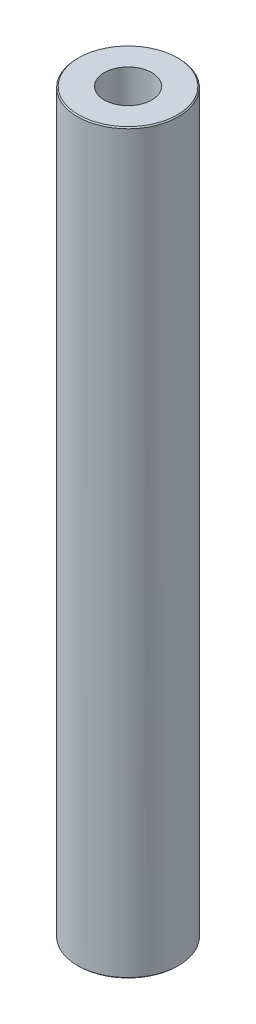
ISO-10303-21;
HEADER;
FILE_DESCRIPTION(('STEP AP214'),'2;1');
FILE_NAME('part.step','',(''),(''),'','','');
FILE_SCHEMA(('AUTOMOTIVE_DESIGN { 1 0 10303 214 1 1 1 1 }'));
ENDSEC;
DATA;
#1=APPLICATION_CONTEXT('core data for automotive mechanical design processes');
#2=APPLICATION_PROTOCOL_DEFINITION('international standard','automotive_design',2000,#1);
#3=PRODUCT_CONTEXT('',#1,'mechanical');
#4=PRODUCT('Part','Part','',(#3));
#5=PRODUCT_RELATED_PRODUCT_CATEGORY('part','',(#4));
#6=PRODUCT_DEFINITION_FORMATION('','',#4);
#7=PRODUCT_DEFINITION_CONTEXT('part definition',#1,'design');
#8=PRODUCT_DEFINITION('design','',#6,#7);
#9=PRODUCT_DEFINITION_SHAPE('','',#8);
#10=(LENGTH_UNIT() NAMED_UNIT(*) SI_UNIT(.MILLI.,.METRE.));
#11=(NAMED_UNIT(*) PLANE_ANGLE_UNIT() SI_UNIT($,.RADIAN.));
#12=(NAMED_UNIT(*) SI_UNIT($,.STERADIAN.) SOLID_ANGLE_UNIT());
#13=UNCERTAINTY_MEASURE_WITH_UNIT(LENGTH_MEASURE(1.E-05),#10,'distance_accuracy_value','');
#14=(GEOMETRIC_REPRESENTATION_CONTEXT(3) GLOBAL_UNCERTAINTY_ASSIGNED_CONTEXT((#13)) GLOBAL_UNIT_ASSIGNED_CONTEXT((#10,
#11,#12)) REPRESENTATION_CONTEXT('',''));
#15=CARTESIAN_POINT('',(0.,0.,0.));
#16=DIRECTION('',(0.,0.,1.));
#17=DIRECTION('',(1.,0.,0.));
#18=AXIS2_PLACEMENT_3D('',#15,#16,#17);
#19=CARTESIAN_POINT('',(0.,583.947641491248,0.));
#20=DIRECTION('',(0.,-1.,0.));
#21=DIRECTION('',(0.,0.,-1.));
#22=AXIS2_PLACEMENT_3D('',#19,#20,#21);
#23=CYLINDRICAL_SURFACE('',#22,40.);
#24=CARTESIAN_POINT('',(0.,583.075890248208,0.));
#25=DIRECTION('',(0.,1.,0.));
#26=DIRECTION('',(0.,0.,1.));
#27=AXIS2_PLACEMENT_3D('',#24,#25,#26);
#28=CIRCLE('',#27,40.);
#29=CARTESIAN_POINT('',(0.,583.075890248208,-40.));
#30=VERTEX_POINT('',#29);
#31=EDGE_CURVE('E50',#30,#30,#28,.F.);
#32=CARTESIAN_POINT('',(0.,0.871751243039287,0.));
#33=DIRECTION('',(0.,1.,0.));
#34=DIRECTION('',(0.,0.,1.));
#35=AXIS2_PLACEMENT_3D('',#32,#33,#34);
#36=CIRCLE('',#35,40.);
#37=CARTESIAN_POINT('',(0.,0.871751243039287,-40.));
#38=VERTEX_POINT('',#37);
#39=EDGE_CURVE('E51',#38,#38,#36,.T.);
#40=CARTESIAN_POINT('',(0.,583.075890248208,-40.));
#41=CARTESIAN_POINT('',(0.,577.011263800237,-40.));
#42=CARTESIAN_POINT('',(0.,570.946637352267,-40.));
#43=CARTESIAN_POINT('',(0.,558.817384456326,-40.));
#44=CARTESIAN_POINT('',(0.,552.752758008355,-40.));
#45=CARTESIAN_POINT('',(0.,540.623505112414,-40.));
#46=CARTESIAN_POINT('',(0.,534.558878664444,-40.));
#47=CARTESIAN_POINT('',(0.,522.429625768503,-40.));
#48=CARTESIAN_POINT('',(0.,516.364999320532,-40.));
#49=CARTESIAN_POINT('',(0.,504.235746424591,-40.));
#50=CARTESIAN_POINT('',(0.,498.171119976621,-40.));
#51=CARTESIAN_POINT('',(0.,486.04186708068,-40.));
#52=CARTESIAN_POINT('',(0.,479.977240632709,-40.));
#53=CARTESIAN_POINT('',(0.,467.847987736768,-40.));
#54=CARTESIAN_POINT('',(0.,461.783361288798,-40.));
#55=CARTESIAN_POINT('',(0.,449.654108392857,-40.));
#56=CARTESIAN_POINT('',(0.,443.589481944886,-40.));
#57=CARTESIAN_POINT('',(0.,431.460229048945,-40.));
#58=CARTESIAN_POINT('',(0.,425.395602600975,-40.));
#59=CARTESIAN_POINT('',(0.,413.266349705034,-40.));
#60=CARTESIAN_POINT('',(0.,407.201723257063,-40.));
#61=CARTESIAN_POINT('',(0.,395.072470361122,-40.));
#62=CARTESIAN_POINT('',(0.,389.007843913152,-40.));
#63=CARTESIAN_POINT('',(0.,376.878591017211,-40.));
#64=CARTESIAN_POINT('',(0.,370.81396456924,-40.));
#65=CARTESIAN_POINT('',(0.,358.684711673299,-40.));
#66=CARTESIAN_POINT('',(0.,352.620085225329,-40.));
#67=CARTESIAN_POINT('',(0.,340.490832329388,-40.));
#68=CARTESIAN_POINT('',(0.,334.426205881417,-40.));
#69=CARTESIAN_POINT('',(0.,322.296952985476,-40.));
#70=CARTESIAN_POINT('',(0.,316.232326537506,-40.));
#71=CARTESIAN_POINT('',(0.,304.103073641565,-40.));
#72=CARTESIAN_POINT('',(0.,298.038447193594,-40.));
#73=CARTESIAN_POINT('',(0.,285.909194297653,-40.));
#74=CARTESIAN_POINT('',(0.,279.844567849683,-40.));
#75=CARTESIAN_POINT('',(0.,267.715314953742,-40.));
#76=CARTESIAN_POINT('',(0.,261.650688505771,-40.));
#77=CARTESIAN_POINT('',(0.,249.52143560983,-40.));
#78=CARTESIAN_POINT('',(0.,243.45680916186,-40.));
#79=CARTESIAN_POINT('',(0.,231.327556265919,-40.));
#80=CARTESIAN_POINT('',(0.,225.262929817948,-40.));
#81=CARTESIAN_POINT('',(0.,213.133676922007,-40.));
#82=CARTESIAN_POINT('',(0.,207.069050474037,-40.));
#83=CARTESIAN_POINT('',(0.,194.939797578096,-40.));
#84=CARTESIAN_POINT('',(0.,188.875171130125,-40.));
#85=CARTESIAN_POINT('',(0.,176.745918234184,-40.));
#86=CARTESIAN_POINT('',(0.,170.681291786214,-40.));
#87=CARTESIAN_POINT('',(0.,158.552038890273,-40.));
#88=CARTESIAN_POINT('',(0.,152.487412442302,-40.));
#89=CARTESIAN_POINT('',(0.,140.358159546361,-40.));
#90=CARTESIAN_POINT('',(0.,134.29353309839,-40.));
#91=CARTESIAN_POINT('',(0.,122.164280202449,-40.));
#92=CARTESIAN_POINT('',(0.,116.099653754479,-40.));
#93=CARTESIAN_POINT('',(0.,103.970400858538,-40.));
#94=CARTESIAN_POINT('',(0.,97.9057744105675,-40.));
#95=CARTESIAN_POINT('',(0.,85.7765215146265,-40.));
#96=CARTESIAN_POINT('',(0.,79.7118950666559,-40.));
#97=CARTESIAN_POINT('',(0.,67.5826421707149,-40.));
#98=CARTESIAN_POINT('',(0.,61.5180157227444,-40.));
#99=CARTESIAN_POINT('',(0.,49.3887628268034,-40.));
#100=CARTESIAN_POINT('',(0.,43.3241363788329,-40.));
#101=CARTESIAN_POINT('',(0.,31.1948834828919,-40.));
#102=CARTESIAN_POINT('',(0.,25.1302570349214,-40.));
#103=CARTESIAN_POINT('',(0.,13.0010041389803,-40.));
#104=CARTESIAN_POINT('',(0.,6.93637769100982,-40.));
#105=CARTESIAN_POINT('',(0.,0.871751243039287,-40.));
#106=B_SPLINE_CURVE_WITH_KNOTS('',3,(#40,#41,#42,#43,#44,#45,#46,#47,#48,#49,#50,#51,#52,#53,
#54,#55,#56,#57,#58,#59,#60,#61,#62,#63,#64,#65,#66,#67,#68,#69,#70,#71,#72,#73,#74,#75,#76,#77,
#78,#79,#80,#81,#82,#83,#84,#85,#86,#87,#88,#89,#90,#91,#92,#93,#94,#95,#96,#97,#98,#99,#100,
#101,#102,#103,#104,#105),.UNSPECIFIED.,.F.,.F.,(4,2,2,2,2,2,2,2,2,2,2,2,2,2,2,2,2,2,2,2,2,2,2,
2,2,2,2,2,2,2,2,2,4),(0.,18.1938793439116,36.3877586878231,54.5816380317347,72.7755173756461,
90.9693967195577,109.163276063469,127.357155407381,145.551034751292,163.744914095204,
181.938793439115,200.132672783027,218.326552126938,236.52043147085,254.714310814761,
272.908190158673,291.102069502584,309.295948846496,327.489828190407,345.683707534319,
363.87758687823,382.071466222142,400.265345566053,418.459224909965,436.653104253877,
454.846983597788,473.0408629417,491.234742285611,509.428621629523,527.622500973434,
545.816380317346,564.010259661257,582.204139005169),.UNSPECIFIED.);
#107=EDGE_CURVE('BSEAM39',#30,#38,#106,.T.);
#108=ORIENTED_EDGE('',*,*,#31,.T.);
#109=ORIENTED_EDGE('',*,*,#39,.T.);
#110=ORIENTED_EDGE('',*,*,#107,.T.);
#111=ORIENTED_EDGE('',*,*,#107,.F.);
#112=EDGE_LOOP('',(#108,#110,#109,#111));
#113=FACE_BOUND('',#112,.T.);
#114=ADVANCED_FACE('F39',(#113),#23,.T.);
#115=CARTESIAN_POINT('',(0.,583.947641491248,0.));
#116=DIRECTION('',(0.,1.,0.));
#117=DIRECTION('',(0.,0.,1.));
#118=AXIS2_PLACEMENT_3D('',#115,#116,#117);
#119=PLANE('',#118);
#120=CARTESIAN_POINT('',(0.,583.947641491248,0.));
#121=DIRECTION('',(0.,1.,0.));
#122=DIRECTION('',(0.,0.,1.));
#123=AXIS2_PLACEMENT_3D('',#120,#121,#122);
#124=CIRCLE('',#123,39.1282487569605);
#125=CARTESIAN_POINT('',(0.,583.947641491247,-39.1282487569606));
#126=VERTEX_POINT('',#125);
#127=EDGE_CURVE('E54',#126,#126,#124,.T.);
#128=ORIENTED_EDGE('',*,*,#127,.T.);
#129=EDGE_LOOP('',(#128));
#130=FACE_BOUND('',#129,.T.);
#131=CARTESIAN_POINT('',(0.,583.947641491248,0.));
#132=DIRECTION('',(0.,1.,0.));
#133=DIRECTION('',(0.,0.,1.));
#134=AXIS2_PLACEMENT_3D('',#131,#132,#133);
#135=CIRCLE('',#134,18.8190526548075);
#136=CARTESIAN_POINT('',(0.,583.947641491248,18.8190526548075));
#137=VERTEX_POINT('',#136);
#138=EDGE_CURVE('E58',#137,#137,#135,.T.);
#139=ORIENTED_EDGE('',*,*,#138,.F.);
#140=EDGE_LOOP('',(#139));
#141=FACE_BOUND('',#140,.T.);
#142=ADVANCED_FACE('F69',(#130,#141),#119,.T.);
#143=CARTESIAN_POINT('',(0.,0.,0.));
#144=DIRECTION('',(0.,1.,0.));
#145=DIRECTION('',(0.,0.,1.));
#146=AXIS2_PLACEMENT_3D('',#143,#144,#145);
#147=PLANE('',#146);
#148=CARTESIAN_POINT('',(0.,0.,0.));
#149=DIRECTION('',(0.,1.,0.));
#150=DIRECTION('',(0.,0.,1.));
#151=AXIS2_PLACEMENT_3D('',#148,#149,#150);
#152=CIRCLE('',#151,39.1282487569607);
#153=CARTESIAN_POINT('',(0.,0.,39.1282487569607));
#154=VERTEX_POINT('',#153);
#155=EDGE_CURVE('E10',#154,#154,#152,.F.);
#156=ORIENTED_EDGE('',*,*,#155,.T.);
#157=EDGE_LOOP('',(#156));
#158=FACE_BOUND('',#157,.T.);
#159=CARTESIAN_POINT('',(0.,0.,0.));
#160=DIRECTION('',(0.,1.,0.));
#161=DIRECTION('',(0.,0.,1.));
#162=AXIS2_PLACEMENT_3D('',#159,#160,#161);
#163=CIRCLE('',#162,18.8190526548075);
#164=CARTESIAN_POINT('',(0.,0.,18.8190526548075));
#165=VERTEX_POINT('',#164);
#166=EDGE_CURVE('E63',#165,#165,#163,.T.);
#167=ORIENTED_EDGE('',*,*,#166,.T.);
#168=EDGE_LOOP('',(#167));
#169=FACE_BOUND('',#168,.T.);
#170=ADVANCED_FACE('F75',(#158,#169),#147,.F.);
#171=CARTESIAN_POINT('',(0.,583.947641491248,0.));
#172=DIRECTION('',(0.,-1.,0.));
#173=DIRECTION('',(0.,0.,-1.));
#174=AXIS2_PLACEMENT_3D('',#171,#172,#173);
#175=CYLINDRICAL_SURFACE('',#174,18.8190526548075);
#176=ORIENTED_EDGE('',*,*,#138,.T.);
#177=EDGE_LOOP('',(#176));
#178=FACE_BOUND('',#177,.T.);
#179=ORIENTED_EDGE('',*,*,#166,.F.);
#180=EDGE_LOOP('',(#179));
#181=FACE_BOUND('',#180,.T.);
#182=ADVANCED_FACE('F70',(#178,#181),#175,.F.);
#183=CARTESIAN_POINT('',(0.,583.947641491248,0.));
#184=DIRECTION('',(0.,-1.,0.));
#185=DIRECTION('',(0.,0.,-1.));
#186=AXIS2_PLACEMENT_3D('',#183,#184,#185);
#187=CONICAL_SURFACE('',#186,39.1282487569605,0.785398163397428);
#188=CARTESIAN_POINT('',(0.,583.075890248208,-40.0000000000001));
#189=CARTESIAN_POINT('',(0.,583.084970990323,-39.9909192578851));
#190=CARTESIAN_POINT('',(0.,583.094051732438,-39.9818385157701));
#191=CARTESIAN_POINT('',(0.,583.112213216668,-39.9636770315401));
#192=CARTESIAN_POINT('',(0.,583.121293958783,-39.9545962894251));
#193=CARTESIAN_POINT('',(0.,583.139455443013,-39.9364348051951));
#194=CARTESIAN_POINT('',(0.,583.148536185128,-39.9273540630801));
#195=CARTESIAN_POINT('',(0.,583.166697669358,-39.9091925788501));
#196=CARTESIAN_POINT('',(0.,583.175778411473,-39.9001118367351));
#197=CARTESIAN_POINT('',(0.,583.193939895703,-39.8819503525051));
#198=CARTESIAN_POINT('',(0.,583.203020637818,-39.8728696103901));
#199=CARTESIAN_POINT('',(0.,583.221182122048,-39.8547081261601));
#200=CARTESIAN_POINT('',(0.,583.230262864163,-39.8456273840452));
#201=CARTESIAN_POINT('',(0.,583.248424348393,-39.8274658998152));
#202=CARTESIAN_POINT('',(0.,583.257505090508,-39.8183851577002));
#203=CARTESIAN_POINT('',(0.,583.275666574738,-39.8002236734702));
#204=CARTESIAN_POINT('',(0.,583.284747316853,-39.7911429313552));
#205=CARTESIAN_POINT('',(0.,583.302908801083,-39.7729814471252));
#206=CARTESIAN_POINT('',(0.,583.311989543198,-39.7639007050102));
#207=CARTESIAN_POINT('',(0.,583.330151027428,-39.7457392207802));
#208=CARTESIAN_POINT('',(0.,583.339231769543,-39.7366584786652));
#209=CARTESIAN_POINT('',(0.,583.357393253773,-39.7184969944352));
#210=CARTESIAN_POINT('',(0.,583.366473995888,-39.7094162523202));
#211=CARTESIAN_POINT('',(0.,583.384635480118,-39.6912547680902));
#212=CARTESIAN_POINT('',(0.,583.393716222233,-39.6821740259753));
#213=CARTESIAN_POINT('',(0.,583.411877706463,-39.6640125417453));
#214=CARTESIAN_POINT('',(0.,583.420958448578,-39.6549317996303));
#215=CARTESIAN_POINT('',(0.,583.439119932808,-39.6367703154003));
#216=CARTESIAN_POINT('',(0.,583.448200674923,-39.6276895732853));
#217=CARTESIAN_POINT('',(0.,583.466362159153,-39.6095280890553));
#218=CARTESIAN_POINT('',(0.,583.475442901268,-39.6004473469403));
#219=CARTESIAN_POINT('',(0.,583.493604385498,-39.5822858627103));
#220=CARTESIAN_POINT('',(0.,583.502685127613,-39.5732051205953));
#221=CARTESIAN_POINT('',(0.,583.520846611843,-39.5550436363653));
#222=CARTESIAN_POINT('',(0.,583.529927353958,-39.5459628942503));
#223=CARTESIAN_POINT('',(0.,583.548088838188,-39.5278014100203));
#224=CARTESIAN_POINT('',(0.,583.557169580303,-39.5187206679053));
#225=CARTESIAN_POINT('',(0.,583.575331064533,-39.5005591836754));
#226=CARTESIAN_POINT('',(0.,583.584411806648,-39.4914784415604));
#227=CARTESIAN_POINT('',(0.,583.602573290878,-39.4733169573304));
#228=CARTESIAN_POINT('',(0.,583.611654032993,-39.4642362152154));
#229=CARTESIAN_POINT('',(0.,583.629815517223,-39.4460747309854));
#230=CARTESIAN_POINT('',(0.,583.638896259338,-39.4369939888704));
#231=CARTESIAN_POINT('',(0.,583.657057743568,-39.4188325046404));
#232=CARTESIAN_POINT('',(0.,583.666138485683,-39.4097517625254));
#233=CARTESIAN_POINT('',(0.,583.684299969913,-39.3915902782954));
#234=CARTESIAN_POINT('',(0.,583.693380712028,-39.3825095361804));
#235=CARTESIAN_POINT('',(0.,583.711542196258,-39.3643480519504));
#236=CARTESIAN_POINT('',(0.,583.720622938373,-39.3552673098354));
#237=CARTESIAN_POINT('',(0.,583.738784422603,-39.3371058256055));
#238=CARTESIAN_POINT('',(0.,583.747865164717,-39.3280250834905));
#239=CARTESIAN_POINT('',(0.,583.766026648948,-39.3098635992605));
#240=CARTESIAN_POINT('',(0.,583.775107391063,-39.3007828571455));
#241=CARTESIAN_POINT('',(0.,583.793268875293,-39.2826213729155));
#242=CARTESIAN_POINT('',(0.,583.802349617407,-39.2735406308005));
#243=CARTESIAN_POINT('',(0.,583.820511101638,-39.2553791465705));
#244=CARTESIAN_POINT('',(0.,583.829591843752,-39.2462984044555));
#245=CARTESIAN_POINT('',(0.,583.847753327983,-39.2281369202255));
#246=CARTESIAN_POINT('',(0.,583.856834070097,-39.2190561781105));
#247=CARTESIAN_POINT('',(0.,583.874995554327,-39.2008946938805));
#248=CARTESIAN_POINT('',(0.,583.884076296442,-39.1918139517655));
#249=CARTESIAN_POINT('',(0.,583.902237780673,-39.1736524675356));
#250=CARTESIAN_POINT('',(0.,583.911318522787,-39.1645717254206));
#251=CARTESIAN_POINT('',(0.,583.929480007017,-39.1464102411906));
#252=CARTESIAN_POINT('',(0.,583.938560749133,-39.1373294990756));
#253=CARTESIAN_POINT('',(0.,583.947641491248,-39.1282487569606));
#254=B_SPLINE_CURVE_WITH_KNOTS('',3,(#188,#189,#190,#191,#192,#193,#194,#195,#196,#197,#198,
#199,#200,#201,#202,#203,#204,#205,#206,#207,#208,#209,#210,#211,#212,#213,#214,#215,#216,#217,
#218,#219,#220,#221,#222,#223,#224,#225,#226,#227,#228,#229,#230,#231,#232,#233,#234,#235,#236,
#237,#238,#239,#240,#241,#242,#243,#244,#245,#246,#247,#248,#249,#250,#251,#252,#253),
.UNSPECIFIED.,.F.,.F.,(4,2,2,2,2,2,2,2,2,2,2,2,2,2,2,2,2,2,2,2,2,2,2,2,2,2,2,2,2,2,2,2,4),(0.,
0.0385263259663885,0.0770526519327035,0.115578977899014,0.154105303865324,0.192631629831638,
0.231157955797949,0.269684281764259,0.308210607730574,0.346736933696884,0.385263259663194,
0.423789585629508,0.462315911595819,0.500842237562129,0.539368563528443,0.577894889494753,
0.616421215461064,0.654947541427378,0.693473867393688,0.732000193360003,0.770526519326313,
0.809052845292623,0.847579171258938,0.886105497225248,0.924631823191558,0.963158149157873,
1.00168447512418,1.04021080109049,1.07873712705681,1.11726345302312,1.15578977898943,
1.19431610495574,1.23284243092213),.UNSPECIFIED.);
#255=EDGE_CURVE('BSEAM81',#30,#126,#254,.T.);
#256=ORIENTED_EDGE('',*,*,#31,.F.);
#257=ORIENTED_EDGE('',*,*,#127,.F.);
#258=ORIENTED_EDGE('',*,*,#255,.T.);
#259=ORIENTED_EDGE('',*,*,#255,.F.);
#260=EDGE_LOOP('',(#256,#258,#257,#259));
#261=FACE_BOUND('',#260,.T.);
#262=ADVANCED_FACE('F81',(#261),#187,.T.);
#263=CARTESIAN_POINT('',(0.,0.871751243039287,0.));
#264=DIRECTION('',(0.,1.,0.));
#265=DIRECTION('',(0.,0.,1.));
#266=AXIS2_PLACEMENT_3D('',#263,#264,#265);
#267=CONICAL_SURFACE('',#266,40.,0.78539816339746);
#268=ORIENTED_EDGE('',*,*,#155,.F.);
#269=EDGE_LOOP('',(#268));
#270=FACE_BOUND('',#269,.T.);
#271=ORIENTED_EDGE('',*,*,#39,.F.);
#272=EDGE_LOOP('',(#271));
#273=FACE_BOUND('',#272,.T.);
#274=ADVANCED_FACE('F45',(#270,#273),#267,.T.);
#275=CLOSED_SHELL('',(#114,#142,#170,#182,#262,#274));
#276=MANIFOLD_SOLID_BREP('B2',#275);
#277=ADVANCED_BREP_SHAPE_REPRESENTATION('',(#18,#276),#14);
#278=SHAPE_DEFINITION_REPRESENTATION(#9,#277);
ENDSEC;
END-ISO-10303-21;
